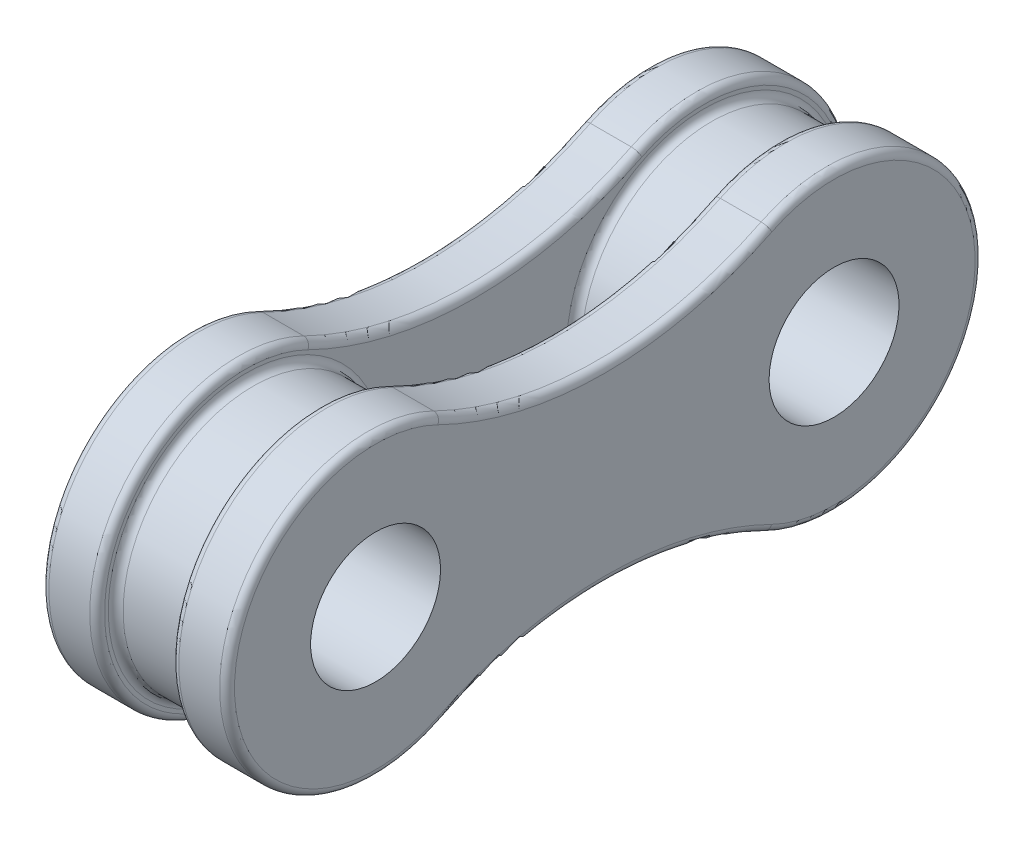
ISO-10303-21;
HEADER;
FILE_DESCRIPTION(('STEP AP214'),'2;1');
FILE_NAME('part.step','',(''),(''),'','','');
FILE_SCHEMA(('AUTOMOTIVE_DESIGN { 1 0 10303 214 1 1 1 1 }'));
ENDSEC;
DATA;
#1=APPLICATION_CONTEXT('core data for automotive mechanical design processes');
#2=APPLICATION_PROTOCOL_DEFINITION('international standard','automotive_design',2000,#1);
#3=PRODUCT_CONTEXT('',#1,'mechanical');
#4=PRODUCT('Part','Part','',(#3));
#5=PRODUCT_RELATED_PRODUCT_CATEGORY('part','',(#4));
#6=PRODUCT_DEFINITION_FORMATION('','',#4);
#7=PRODUCT_DEFINITION_CONTEXT('part definition',#1,'design');
#8=PRODUCT_DEFINITION('design','',#6,#7);
#9=PRODUCT_DEFINITION_SHAPE('','',#8);
#10=(LENGTH_UNIT() NAMED_UNIT(*) SI_UNIT(.MILLI.,.METRE.));
#11=(NAMED_UNIT(*) PLANE_ANGLE_UNIT() SI_UNIT($,.RADIAN.));
#12=(NAMED_UNIT(*) SI_UNIT($,.STERADIAN.) SOLID_ANGLE_UNIT());
#13=UNCERTAINTY_MEASURE_WITH_UNIT(LENGTH_MEASURE(1.E-05),#10,'distance_accuracy_value','');
#14=(GEOMETRIC_REPRESENTATION_CONTEXT(3) GLOBAL_UNCERTAINTY_ASSIGNED_CONTEXT((#13)) GLOBAL_UNIT_ASSIGNED_CONTEXT((#10,
#11,#12)) REPRESENTATION_CONTEXT('',''));
#15=CARTESIAN_POINT('',(0.,0.,0.));
#16=DIRECTION('',(0.,0.,1.));
#17=DIRECTION('',(1.,0.,0.));
#18=AXIS2_PLACEMENT_3D('',#15,#16,#17);
#19=CARTESIAN_POINT('',(2.5,6.2823040160438,-3.0875));
#20=DIRECTION('',(1.,0.,0.));
#21=DIRECTION('',(0.,0.,-1.));
#22=AXIS2_PLACEMENT_3D('',#19,#20,#21);
#23=PLANE('',#22);
#24=CARTESIAN_POINT('',(2.5,-12.5646080320876,0.));
#25=DIRECTION('',(1.,0.,0.));
#26=DIRECTION('',(0.,0.,-1.));
#27=AXIS2_PLACEMENT_3D('',#24,#25,#26);
#28=CIRCLE('',#27,10.2);
#29=CARTESIAN_POINT('',(2.5,-3.41039360870949,4.49892857142857));
#30=VERTEX_POINT('',#29);
#31=CARTESIAN_POINT('',(2.5,-3.41039360870949,-4.49892857142857));
#32=VERTEX_POINT('',#31);
#33=EDGE_CURVE('E188',#30,#32,#28,.F.);
#34=ORIENTED_EDGE('',*,*,#33,.T.);
#35=CARTESIAN_POINT('',(2.5,0.,-6.175));
#36=DIRECTION('',(1.,0.,0.));
#37=DIRECTION('',(0.,0.,-1.));
#38=AXIS2_PLACEMENT_3D('',#35,#36,#37);
#39=CIRCLE('',#38,3.8);
#40=CARTESIAN_POINT('',(2.5,3.41039360870949,-4.49892857142857));
#41=VERTEX_POINT('',#40);
#42=EDGE_CURVE('E168',#32,#41,#39,.T.);
#43=ORIENTED_EDGE('',*,*,#42,.T.);
#44=CARTESIAN_POINT('',(2.5,12.5646080320876,0.));
#45=DIRECTION('',(1.,0.,0.));
#46=DIRECTION('',(0.,0.,-1.));
#47=AXIS2_PLACEMENT_3D('',#44,#45,#46);
#48=CIRCLE('',#47,10.2);
#49=CARTESIAN_POINT('',(2.5,3.41039360870949,4.49892857142857));
#50=VERTEX_POINT('',#49);
#51=EDGE_CURVE('E177',#41,#50,#48,.F.);
#52=ORIENTED_EDGE('',*,*,#51,.T.);
#53=CARTESIAN_POINT('',(2.5,0.,6.175));
#54=DIRECTION('',(1.,0.,0.));
#55=DIRECTION('',(0.,0.,-1.));
#56=AXIS2_PLACEMENT_3D('',#53,#54,#55);
#57=CIRCLE('',#56,3.8);
#58=EDGE_CURVE('E183',#50,#30,#57,.T.);
#59=ORIENTED_EDGE('',*,*,#58,.T.);
#60=EDGE_LOOP('',(#34,#43,#52,#59));
#61=FACE_BOUND('',#60,.T.);
#62=CARTESIAN_POINT('',(2.5,0.,6.175));
#63=DIRECTION('',(1.,0.,0.));
#64=DIRECTION('',(0.,0.,-1.));
#65=AXIS2_PLACEMENT_3D('',#62,#63,#64);
#66=CIRCLE('',#65,1.75);
#67=CARTESIAN_POINT('',(2.5,0.,4.425));
#68=VERTEX_POINT('',#67);
#69=EDGE_CURVE('E746',#68,#68,#66,.T.);
#70=ORIENTED_EDGE('',*,*,#69,.F.);
#71=EDGE_LOOP('',(#70));
#72=FACE_BOUND('',#71,.T.);
#73=CARTESIAN_POINT('',(2.5,0.,-6.175));
#74=DIRECTION('',(1.,0.,0.));
#75=DIRECTION('',(0.,0.,1.));
#76=AXIS2_PLACEMENT_3D('',#73,#74,#75);
#77=CIRCLE('',#76,1.75);
#78=CARTESIAN_POINT('',(2.5,0.,-4.425));
#79=VERTEX_POINT('',#78);
#80=EDGE_CURVE('E743',#79,#79,#77,.T.);
#81=ORIENTED_EDGE('',*,*,#80,.F.);
#82=EDGE_LOOP('',(#81));
#83=FACE_BOUND('',#82,.T.);
#84=ADVANCED_FACE('F48',(#61,#72,#83),#23,.T.);
#85=CARTESIAN_POINT('',(1.,6.2823040160438,-3.0875));
#86=DIRECTION('',(1.,0.,0.));
#87=DIRECTION('',(0.,0.,-1.));
#88=AXIS2_PLACEMENT_3D('',#85,#86,#87);
#89=PLANE('',#88);
#90=CARTESIAN_POINT('',(1.,-12.5646080320876,0.));
#91=DIRECTION('',(1.,0.,0.));
#92=DIRECTION('',(0.,0.,-1.));
#93=AXIS2_PLACEMENT_3D('',#90,#91,#92);
#94=CIRCLE('',#93,10.2);
#95=CARTESIAN_POINT('',(1.,-3.41039360870949,-4.49892857142857));
#96=VERTEX_POINT('',#95);
#97=CARTESIAN_POINT('',(1.,-3.41039360870949,4.49892857142857));
#98=VERTEX_POINT('',#97);
#99=EDGE_CURVE('E216',#96,#98,#94,.T.);
#100=ORIENTED_EDGE('',*,*,#99,.T.);
#101=CARTESIAN_POINT('',(1.,0.,6.175));
#102=DIRECTION('',(1.,0.,0.));
#103=DIRECTION('',(0.,0.,-1.));
#104=AXIS2_PLACEMENT_3D('',#101,#102,#103);
#105=CIRCLE('',#104,3.8);
#106=CARTESIAN_POINT('',(1.,3.41039360870949,4.49892857142857));
#107=VERTEX_POINT('',#106);
#108=EDGE_CURVE('E218',#98,#107,#105,.F.);
#109=ORIENTED_EDGE('',*,*,#108,.T.);
#110=CARTESIAN_POINT('',(1.,12.5646080320876,0.));
#111=DIRECTION('',(1.,0.,0.));
#112=DIRECTION('',(0.,0.,-1.));
#113=AXIS2_PLACEMENT_3D('',#110,#111,#112);
#114=CIRCLE('',#113,10.2);
#115=CARTESIAN_POINT('',(1.,3.41039360870949,-4.49892857142857));
#116=VERTEX_POINT('',#115);
#117=EDGE_CURVE('E212',#107,#116,#114,.T.);
#118=ORIENTED_EDGE('',*,*,#117,.T.);
#119=CARTESIAN_POINT('',(1.,0.,-6.175));
#120=DIRECTION('',(1.,0.,0.));
#121=DIRECTION('',(0.,0.,-1.));
#122=AXIS2_PLACEMENT_3D('',#119,#120,#121);
#123=CIRCLE('',#122,3.8);
#124=EDGE_CURVE('E214',#116,#96,#123,.F.);
#125=ORIENTED_EDGE('',*,*,#124,.T.);
#126=EDGE_LOOP('',(#100,#109,#118,#125));
#127=FACE_BOUND('',#126,.T.);
#128=CARTESIAN_POINT('',(1.,0.,-6.175));
#129=DIRECTION('',(1.,0.,0.));
#130=DIRECTION('',(0.,0.,-1.));
#131=AXIS2_PLACEMENT_3D('',#128,#129,#130);
#132=CIRCLE('',#131,3.7);
#133=CARTESIAN_POINT('',(1.,0.,-9.875));
#134=VERTEX_POINT('',#133);
#135=EDGE_CURVE('E209',#134,#134,#132,.T.);
#136=ORIENTED_EDGE('',*,*,#135,.T.);
#137=EDGE_LOOP('',(#136));
#138=FACE_BOUND('',#137,.T.);
#139=CARTESIAN_POINT('',(1.,0.,6.175));
#140=DIRECTION('',(1.,0.,0.));
#141=DIRECTION('',(0.,0.,-1.));
#142=AXIS2_PLACEMENT_3D('',#139,#140,#141);
#143=CIRCLE('',#142,3.7);
#144=CARTESIAN_POINT('',(1.,0.,2.475));
#145=VERTEX_POINT('',#144);
#146=EDGE_CURVE('E206',#145,#145,#143,.T.);
#147=ORIENTED_EDGE('',*,*,#146,.T.);
#148=EDGE_LOOP('',(#147));
#149=FACE_BOUND('',#148,.T.);
#150=ADVANCED_FACE('F350',(#127,#138,#149),#89,.F.);
#151=CARTESIAN_POINT('',(2.5,12.5646080320876,0.));
#152=DIRECTION('',(-1.,0.,0.));
#153=DIRECTION('',(0.,0.,1.));
#154=AXIS2_PLACEMENT_3D('',#151,#152,#153);
#155=CYLINDRICAL_SURFACE('',#154,10.);
#156=DIRECTION('',(-1.,0.,0.));
#157=VECTOR('',#156,1.);
#158=CARTESIAN_POINT('',(2.5,3.58988800916788,-4.41071428571429));
#159=LINE('',#158,#157);
#160=CARTESIAN_POINT('',(2.3,3.58988800916788,-4.41071428571429));
#161=VERTEX_POINT('',#160);
#162=CARTESIAN_POINT('',(1.2,3.58988800916788,-4.41071428571429));
#163=VERTEX_POINT('',#162);
#164=EDGE_CURVE('E750',#161,#163,#159,.T.);
#165=ORIENTED_EDGE('',*,*,#164,.T.);
#166=CARTESIAN_POINT('',(1.2,12.5646080320876,0.));
#167=DIRECTION('',(1.,0.,0.));
#168=DIRECTION('',(0.,0.,-1.));
#169=AXIS2_PLACEMENT_3D('',#166,#167,#168);
#170=CIRCLE('',#169,10.);
#171=CARTESIAN_POINT('',(1.2,3.58988800916788,4.41071428571429));
#172=VERTEX_POINT('',#171);
#173=EDGE_CURVE('E223',#163,#172,#170,.F.);
#174=ORIENTED_EDGE('',*,*,#173,.T.);
#175=DIRECTION('',(-1.,0.,0.));
#176=VECTOR('',#175,1.);
#177=CARTESIAN_POINT('',(2.5,3.58988800916788,4.41071428571429));
#178=LINE('',#177,#176);
#179=CARTESIAN_POINT('',(2.3,3.58988800916788,4.41071428571429));
#180=VERTEX_POINT('',#179);
#181=EDGE_CURVE('E184',#180,#172,#178,.T.);
#182=ORIENTED_EDGE('',*,*,#181,.F.);
#183=CARTESIAN_POINT('',(2.3,12.5646080320876,0.));
#184=DIRECTION('',(1.,0.,0.));
#185=DIRECTION('',(0.,0.,-1.));
#186=AXIS2_PLACEMENT_3D('',#183,#184,#185);
#187=CIRCLE('',#186,10.);
#188=EDGE_CURVE('E221',#180,#161,#187,.T.);
#189=ORIENTED_EDGE('',*,*,#188,.T.);
#190=EDGE_LOOP('',(#165,#174,#182,#189));
#191=FACE_BOUND('',#190,.T.);
#192=ADVANCED_FACE('F355',(#191),#155,.F.);
#193=CARTESIAN_POINT('',(2.5,0.,6.175));
#194=DIRECTION('',(-1.,0.,0.));
#195=DIRECTION('',(0.,0.,1.));
#196=AXIS2_PLACEMENT_3D('',#193,#194,#195);
#197=CYLINDRICAL_SURFACE('',#196,4.);
#198=DIRECTION('',(-1.,0.,0.));
#199=VECTOR('',#198,1.);
#200=CARTESIAN_POINT('',(2.5,-3.58988800916788,4.41071428571429));
#201=LINE('',#200,#199);
#202=CARTESIAN_POINT('',(2.3,-3.58988800916788,4.41071428571429));
#203=VERTEX_POINT('',#202);
#204=CARTESIAN_POINT('',(1.2,-3.58988800916788,4.41071428571429));
#205=VERTEX_POINT('',#204);
#206=EDGE_CURVE('E756',#203,#205,#201,.T.);
#207=ORIENTED_EDGE('',*,*,#206,.F.);
#208=CARTESIAN_POINT('',(2.3,0.,6.175));
#209=DIRECTION('',(1.,0.,0.));
#210=DIRECTION('',(0.,0.,-1.));
#211=AXIS2_PLACEMENT_3D('',#208,#209,#210);
#212=CIRCLE('',#211,4.);
#213=EDGE_CURVE('E204',#203,#180,#212,.F.);
#214=ORIENTED_EDGE('',*,*,#213,.T.);
#215=ORIENTED_EDGE('',*,*,#181,.T.);
#216=CARTESIAN_POINT('',(1.2,0.,6.175));
#217=DIRECTION('',(1.,0.,0.));
#218=DIRECTION('',(0.,0.,-1.));
#219=AXIS2_PLACEMENT_3D('',#216,#217,#218);
#220=CIRCLE('',#219,4.);
#221=EDGE_CURVE('E201',#172,#205,#220,.T.);
#222=ORIENTED_EDGE('',*,*,#221,.T.);
#223=EDGE_LOOP('',(#207,#214,#215,#222));
#224=FACE_BOUND('',#223,.T.);
#225=ADVANCED_FACE('F369',(#224),#197,.T.);
#226=CARTESIAN_POINT('',(2.5,-12.5646080320876,0.));
#227=DIRECTION('',(-1.,0.,0.));
#228=DIRECTION('',(0.,0.,1.));
#229=AXIS2_PLACEMENT_3D('',#226,#227,#228);
#230=CYLINDRICAL_SURFACE('',#229,10.);
#231=DIRECTION('',(-1.,0.,0.));
#232=VECTOR('',#231,1.);
#233=CARTESIAN_POINT('',(2.5,-3.58988800916788,-4.41071428571429));
#234=LINE('',#233,#232);
#235=CARTESIAN_POINT('',(2.3,-3.58988800916788,-4.41071428571429));
#236=VERTEX_POINT('',#235);
#237=CARTESIAN_POINT('',(1.2,-3.58988800916788,-4.41071428571429));
#238=VERTEX_POINT('',#237);
#239=EDGE_CURVE('E753',#236,#238,#234,.T.);
#240=ORIENTED_EDGE('',*,*,#239,.F.);
#241=CARTESIAN_POINT('',(2.3,-12.5646080320876,0.));
#242=DIRECTION('',(1.,0.,0.));
#243=DIRECTION('',(0.,0.,-1.));
#244=AXIS2_PLACEMENT_3D('',#241,#242,#243);
#245=CIRCLE('',#244,10.);
#246=EDGE_CURVE('E199',#236,#203,#245,.T.);
#247=ORIENTED_EDGE('',*,*,#246,.T.);
#248=ORIENTED_EDGE('',*,*,#206,.T.);
#249=CARTESIAN_POINT('',(1.2,-12.5646080320876,0.));
#250=DIRECTION('',(1.,0.,0.));
#251=DIRECTION('',(0.,0.,-1.));
#252=AXIS2_PLACEMENT_3D('',#249,#250,#251);
#253=CIRCLE('',#252,10.);
#254=EDGE_CURVE('E197',#205,#238,#253,.F.);
#255=ORIENTED_EDGE('',*,*,#254,.T.);
#256=EDGE_LOOP('',(#240,#247,#248,#255));
#257=FACE_BOUND('',#256,.T.);
#258=ADVANCED_FACE('F365',(#257),#230,.F.);
#259=CARTESIAN_POINT('',(2.5,0.,-6.175));
#260=DIRECTION('',(-1.,0.,0.));
#261=DIRECTION('',(0.,0.,1.));
#262=AXIS2_PLACEMENT_3D('',#259,#260,#261);
#263=CYLINDRICAL_SURFACE('',#262,4.);
#264=ORIENTED_EDGE('',*,*,#164,.F.);
#265=CARTESIAN_POINT('',(2.3,0.,-6.175));
#266=DIRECTION('',(1.,0.,0.));
#267=DIRECTION('',(0.,0.,-1.));
#268=AXIS2_PLACEMENT_3D('',#265,#266,#267);
#269=CIRCLE('',#268,4.);
#270=EDGE_CURVE('E170',#161,#236,#269,.F.);
#271=ORIENTED_EDGE('',*,*,#270,.T.);
#272=ORIENTED_EDGE('',*,*,#239,.T.);
#273=CARTESIAN_POINT('',(1.2,0.,-6.175));
#274=DIRECTION('',(1.,0.,0.));
#275=DIRECTION('',(0.,0.,-1.));
#276=AXIS2_PLACEMENT_3D('',#273,#274,#275);
#277=CIRCLE('',#276,4.);
#278=EDGE_CURVE('E190',#238,#163,#277,.T.);
#279=ORIENTED_EDGE('',*,*,#278,.T.);
#280=EDGE_LOOP('',(#264,#271,#272,#279));
#281=FACE_BOUND('',#280,.T.);
#282=ADVANCED_FACE('F362',(#281),#263,.T.);
#283=CARTESIAN_POINT('',(2.5,0.,6.175));
#284=DIRECTION('',(-1.,0.,0.));
#285=DIRECTION('',(0.,0.,1.));
#286=AXIS2_PLACEMENT_3D('',#283,#284,#285);
#287=CYLINDRICAL_SURFACE('',#286,1.75);
#288=CARTESIAN_POINT('',(-2.3,0.,6.175));
#289=DIRECTION('',(1.,0.,0.));
#290=DIRECTION('',(0.,0.,-1.));
#291=AXIS2_PLACEMENT_3D('',#288,#289,#290);
#292=CIRCLE('',#291,1.75);
#293=CARTESIAN_POINT('',(-2.3,0.,4.425));
#294=VERTEX_POINT('',#293);
#295=EDGE_CURVE('E12',#294,#294,#292,.F.);
#296=ORIENTED_EDGE('',*,*,#295,.T.);
#297=EDGE_LOOP('',(#296));
#298=FACE_BOUND('',#297,.T.);
#299=ORIENTED_EDGE('',*,*,#69,.T.);
#300=EDGE_LOOP('',(#299));
#301=FACE_BOUND('',#300,.T.);
#302=ADVANCED_FACE('F359',(#298,#301),#287,.F.);
#303=CARTESIAN_POINT('',(2.5,0.,-6.175));
#304=DIRECTION('',(-1.,0.,0.));
#305=DIRECTION('',(0.,0.,1.));
#306=AXIS2_PLACEMENT_3D('',#303,#304,#305);
#307=CYLINDRICAL_SURFACE('',#306,1.75);
#308=CARTESIAN_POINT('',(-2.3,0.,-6.175));
#309=DIRECTION('',(1.,0.,0.));
#310=DIRECTION('',(0.,0.,-1.));
#311=AXIS2_PLACEMENT_3D('',#308,#309,#310);
#312=CIRCLE('',#311,1.75);
#313=CARTESIAN_POINT('',(-2.3,0.,-7.925));
#314=VERTEX_POINT('',#313);
#315=EDGE_CURVE('E57',#314,#314,#312,.F.);
#316=ORIENTED_EDGE('',*,*,#315,.T.);
#317=EDGE_LOOP('',(#316));
#318=FACE_BOUND('',#317,.T.);
#319=ORIENTED_EDGE('',*,*,#80,.T.);
#320=EDGE_LOOP('',(#319));
#321=FACE_BOUND('',#320,.T.);
#322=ADVANCED_FACE('F577',(#318,#321),#307,.F.);
#323=CARTESIAN_POINT('',(-2.502,0.,-6.175));
#324=DIRECTION('',(1.,0.,0.));
#325=DIRECTION('',(0.,0.,-1.));
#326=AXIS2_PLACEMENT_3D('',#323,#324,#325);
#327=CYLINDRICAL_SURFACE('',#326,3.5);
#328=CARTESIAN_POINT('',(0.8,0.,-6.175));
#329=DIRECTION('',(1.,0.,0.));
#330=DIRECTION('',(0.,0.,-1.));
#331=AXIS2_PLACEMENT_3D('',#328,#329,#330);
#332=CIRCLE('',#331,3.5);
#333=CARTESIAN_POINT('',(0.8,0.,-9.675));
#334=VERTEX_POINT('',#333);
#335=EDGE_CURVE('E228',#334,#334,#332,.F.);
#336=ORIENTED_EDGE('',*,*,#335,.T.);
#337=EDGE_LOOP('',(#336));
#338=FACE_BOUND('',#337,.T.);
#339=CARTESIAN_POINT('',(-0.8,0.,-6.175));
#340=DIRECTION('',(1.,0.,0.));
#341=DIRECTION('',(0.,0.,-1.));
#342=AXIS2_PLACEMENT_3D('',#339,#340,#341);
#343=CIRCLE('',#342,3.5);
#344=CARTESIAN_POINT('',(-0.8,0.,-9.675));
#345=VERTEX_POINT('',#344);
#346=EDGE_CURVE('E225',#345,#345,#343,.T.);
#347=ORIENTED_EDGE('',*,*,#346,.T.);
#348=EDGE_LOOP('',(#347));
#349=FACE_BOUND('',#348,.T.);
#350=ADVANCED_FACE('F570',(#338,#349),#327,.T.);
#351=CARTESIAN_POINT('',(-2.5,0.,6.175));
#352=DIRECTION('',(1.,0.,0.));
#353=DIRECTION('',(0.,0.,-1.));
#354=AXIS2_PLACEMENT_3D('',#351,#352,#353);
#355=CYLINDRICAL_SURFACE('',#354,4.);
#356=DIRECTION('',(1.,0.,0.));
#357=VECTOR('',#356,1.);
#358=CARTESIAN_POINT('',(-2.5,-3.58988800916789,4.41071428571429));
#359=LINE('',#358,#357);
#360=CARTESIAN_POINT('',(-2.3,-3.58988800916789,4.41071428571429));
#361=VERTEX_POINT('',#360);
#362=CARTESIAN_POINT('',(-1.2,-3.58988800916789,4.41071428571429));
#363=VERTEX_POINT('',#362);
#364=EDGE_CURVE('E289',#361,#363,#359,.T.);
#365=ORIENTED_EDGE('',*,*,#364,.T.);
#366=CARTESIAN_POINT('',(-1.2,0.,6.175));
#367=DIRECTION('',(1.,0.,0.));
#368=DIRECTION('',(0.,0.,-1.));
#369=AXIS2_PLACEMENT_3D('',#366,#367,#368);
#370=CIRCLE('',#369,4.);
#371=CARTESIAN_POINT('',(-1.2,3.58988800916788,4.41071428571429));
#372=VERTEX_POINT('',#371);
#373=EDGE_CURVE('E268',#363,#372,#370,.F.);
#374=ORIENTED_EDGE('',*,*,#373,.T.);
#375=DIRECTION('',(1.,0.,0.));
#376=VECTOR('',#375,1.);
#377=CARTESIAN_POINT('',(-2.5,3.58988800916788,4.41071428571429));
#378=LINE('',#377,#376);
#379=CARTESIAN_POINT('',(-2.3,3.58988800916788,4.41071428571429));
#380=VERTEX_POINT('',#379);
#381=EDGE_CURVE('E747',#380,#372,#378,.T.);
#382=ORIENTED_EDGE('',*,*,#381,.F.);
#383=CARTESIAN_POINT('',(-2.3,0.,6.175));
#384=DIRECTION('',(1.,0.,0.));
#385=DIRECTION('',(0.,0.,-1.));
#386=AXIS2_PLACEMENT_3D('',#383,#384,#385);
#387=CIRCLE('',#386,4.);
#388=EDGE_CURVE('E266',#380,#361,#387,.T.);
#389=ORIENTED_EDGE('',*,*,#388,.T.);
#390=EDGE_LOOP('',(#365,#374,#382,#389));
#391=FACE_BOUND('',#390,.T.);
#392=ADVANCED_FACE('F576',(#391),#355,.T.);
#393=CARTESIAN_POINT('',(-2.5,12.5646080320876,0.));
#394=DIRECTION('',(1.,0.,0.));
#395=DIRECTION('',(0.,0.,-1.));
#396=AXIS2_PLACEMENT_3D('',#393,#394,#395);
#397=CYLINDRICAL_SURFACE('',#396,10.);
#398=ORIENTED_EDGE('',*,*,#381,.T.);
#399=CARTESIAN_POINT('',(-1.2,12.5646080320876,0.));
#400=DIRECTION('',(1.,0.,0.));
#401=DIRECTION('',(0.,0.,-1.));
#402=AXIS2_PLACEMENT_3D('',#399,#400,#401);
#403=CIRCLE('',#402,10.);
#404=CARTESIAN_POINT('',(-1.2,3.58988800916788,-4.41071428571429));
#405=VERTEX_POINT('',#404);
#406=EDGE_CURVE('E254',#372,#405,#403,.T.);
#407=ORIENTED_EDGE('',*,*,#406,.T.);
#408=DIRECTION('',(1.,0.,0.));
#409=VECTOR('',#408,1.);
#410=CARTESIAN_POINT('',(-2.5,3.58988800916788,-4.41071428571429));
#411=LINE('',#410,#409);
#412=CARTESIAN_POINT('',(-2.3,3.58988800916788,-4.41071428571429));
#413=VERTEX_POINT('',#412);
#414=EDGE_CURVE('E739',#413,#405,#411,.T.);
#415=ORIENTED_EDGE('',*,*,#414,.F.);
#416=CARTESIAN_POINT('',(-2.3,12.5646080320876,0.));
#417=DIRECTION('',(1.,0.,0.));
#418=DIRECTION('',(0.,0.,-1.));
#419=AXIS2_PLACEMENT_3D('',#416,#417,#418);
#420=CIRCLE('',#419,10.);
#421=EDGE_CURVE('E252',#413,#380,#420,.F.);
#422=ORIENTED_EDGE('',*,*,#421,.T.);
#423=EDGE_LOOP('',(#398,#407,#415,#422));
#424=FACE_BOUND('',#423,.T.);
#425=ADVANCED_FACE('F648',(#424),#397,.F.);
#426=CARTESIAN_POINT('',(-2.5,0.,-6.175));
#427=DIRECTION('',(1.,0.,0.));
#428=DIRECTION('',(0.,0.,-1.));
#429=AXIS2_PLACEMENT_3D('',#426,#427,#428);
#430=CYLINDRICAL_SURFACE('',#429,4.);
#431=ORIENTED_EDGE('',*,*,#414,.T.);
#432=CARTESIAN_POINT('',(-1.2,0.,-6.175));
#433=DIRECTION('',(1.,0.,0.));
#434=DIRECTION('',(0.,0.,-1.));
#435=AXIS2_PLACEMENT_3D('',#432,#433,#434);
#436=CIRCLE('',#435,4.);
#437=CARTESIAN_POINT('',(-1.2,-3.58988800916788,-4.41071428571429));
#438=VERTEX_POINT('',#437);
#439=EDGE_CURVE('E259',#405,#438,#436,.F.);
#440=ORIENTED_EDGE('',*,*,#439,.T.);
#441=DIRECTION('',(1.,0.,0.));
#442=VECTOR('',#441,1.);
#443=CARTESIAN_POINT('',(-2.5,-3.58988800916788,-4.41071428571429));
#444=LINE('',#443,#442);
#445=CARTESIAN_POINT('',(-2.3,-3.58988800916788,-4.41071428571429));
#446=VERTEX_POINT('',#445);
#447=EDGE_CURVE('E735',#446,#438,#444,.T.);
#448=ORIENTED_EDGE('',*,*,#447,.F.);
#449=CARTESIAN_POINT('',(-2.3,0.,-6.175));
#450=DIRECTION('',(1.,0.,0.));
#451=DIRECTION('',(0.,0.,-1.));
#452=AXIS2_PLACEMENT_3D('',#449,#450,#451);
#453=CIRCLE('',#452,4.);
#454=EDGE_CURVE('E257',#446,#413,#453,.T.);
#455=ORIENTED_EDGE('',*,*,#454,.T.);
#456=EDGE_LOOP('',(#431,#440,#448,#455));
#457=FACE_BOUND('',#456,.T.);
#458=ADVANCED_FACE('F657',(#457),#430,.T.);
#459=CARTESIAN_POINT('',(-2.5,-12.5646080320876,0.));
#460=DIRECTION('',(1.,0.,0.));
#461=DIRECTION('',(0.,0.,-1.));
#462=AXIS2_PLACEMENT_3D('',#459,#460,#461);
#463=CYLINDRICAL_SURFACE('',#462,10.);
#464=ORIENTED_EDGE('',*,*,#447,.T.);
#465=CARTESIAN_POINT('',(-1.2,-12.5646080320876,0.));
#466=DIRECTION('',(1.,0.,0.));
#467=DIRECTION('',(0.,0.,-1.));
#468=AXIS2_PLACEMENT_3D('',#465,#466,#467);
#469=CIRCLE('',#468,10.);
#470=EDGE_CURVE('E264',#438,#363,#469,.T.);
#471=ORIENTED_EDGE('',*,*,#470,.T.);
#472=ORIENTED_EDGE('',*,*,#364,.F.);
#473=CARTESIAN_POINT('',(-2.3,-12.5646080320876,0.));
#474=DIRECTION('',(1.,0.,0.));
#475=DIRECTION('',(0.,0.,-1.));
#476=AXIS2_PLACEMENT_3D('',#473,#474,#475);
#477=CIRCLE('',#476,10.);
#478=EDGE_CURVE('E261',#361,#446,#477,.F.);
#479=ORIENTED_EDGE('',*,*,#478,.T.);
#480=EDGE_LOOP('',(#464,#471,#472,#479));
#481=FACE_BOUND('',#480,.T.);
#482=ADVANCED_FACE('F335',(#481),#463,.F.);
#483=CARTESIAN_POINT('',(-2.5,-6.2823040160438,3.0875));
#484=DIRECTION('',(1.,0.,0.));
#485=DIRECTION('',(0.,0.,-1.));
#486=AXIS2_PLACEMENT_3D('',#483,#484,#485);
#487=PLANE('',#486);
#488=CARTESIAN_POINT('',(-2.5,0.,-6.175));
#489=DIRECTION('',(1.,0.,0.));
#490=DIRECTION('',(0.,0.,-1.));
#491=AXIS2_PLACEMENT_3D('',#488,#489,#490);
#492=CIRCLE('',#491,3.8);
#493=CARTESIAN_POINT('',(-2.5,3.41039360870949,-4.49892857142857));
#494=VERTEX_POINT('',#493);
#495=CARTESIAN_POINT('',(-2.5,-3.41039360870949,-4.49892857142857));
#496=VERTEX_POINT('',#495);
#497=EDGE_CURVE('E65',#494,#496,#492,.F.);
#498=ORIENTED_EDGE('',*,*,#497,.T.);
#499=CARTESIAN_POINT('',(-2.5,-12.5646080320876,0.));
#500=DIRECTION('',(1.,0.,0.));
#501=DIRECTION('',(0.,0.,-1.));
#502=AXIS2_PLACEMENT_3D('',#499,#500,#501);
#503=CIRCLE('',#502,10.2);
#504=CARTESIAN_POINT('',(-2.5,-3.41039360870949,4.49892857142858));
#505=VERTEX_POINT('',#504);
#506=EDGE_CURVE('E280',#496,#505,#503,.T.);
#507=ORIENTED_EDGE('',*,*,#506,.T.);
#508=CARTESIAN_POINT('',(-2.5,0.,6.175));
#509=DIRECTION('',(1.,0.,0.));
#510=DIRECTION('',(0.,0.,-1.));
#511=AXIS2_PLACEMENT_3D('',#508,#509,#510);
#512=CIRCLE('',#511,3.8);
#513=CARTESIAN_POINT('',(-2.5,3.41039360870949,4.49892857142857));
#514=VERTEX_POINT('',#513);
#515=EDGE_CURVE('E276',#505,#514,#512,.F.);
#516=ORIENTED_EDGE('',*,*,#515,.T.);
#517=CARTESIAN_POINT('',(-2.5,12.5646080320876,0.));
#518=DIRECTION('',(1.,0.,0.));
#519=DIRECTION('',(0.,0.,-1.));
#520=AXIS2_PLACEMENT_3D('',#517,#518,#519);
#521=CIRCLE('',#520,10.2);
#522=EDGE_CURVE('E70',#514,#494,#521,.T.);
#523=ORIENTED_EDGE('',*,*,#522,.T.);
#524=EDGE_LOOP('',(#498,#507,#516,#523));
#525=FACE_BOUND('',#524,.T.);
#526=CARTESIAN_POINT('',(-2.5,0.,-6.175));
#527=DIRECTION('',(1.,0.,0.));
#528=DIRECTION('',(0.,0.,-1.));
#529=AXIS2_PLACEMENT_3D('',#526,#527,#528);
#530=CIRCLE('',#529,1.95);
#531=CARTESIAN_POINT('',(-2.5,0.,-8.125));
#532=VERTEX_POINT('',#531);
#533=EDGE_CURVE('E273',#532,#532,#530,.T.);
#534=ORIENTED_EDGE('',*,*,#533,.T.);
#535=EDGE_LOOP('',(#534));
#536=FACE_BOUND('',#535,.T.);
#537=CARTESIAN_POINT('',(-2.5,0.,6.175));
#538=DIRECTION('',(1.,0.,0.));
#539=DIRECTION('',(0.,0.,-1.));
#540=AXIS2_PLACEMENT_3D('',#537,#538,#539);
#541=CIRCLE('',#540,1.95);
#542=CARTESIAN_POINT('',(-2.5,0.,4.225));
#543=VERTEX_POINT('',#542);
#544=EDGE_CURVE('E270',#543,#543,#541,.T.);
#545=ORIENTED_EDGE('',*,*,#544,.T.);
#546=EDGE_LOOP('',(#545));
#547=FACE_BOUND('',#546,.T.);
#548=ADVANCED_FACE('F331',(#525,#536,#547),#487,.F.);
#549=CARTESIAN_POINT('',(-1.,-6.2823040160438,3.0875));
#550=DIRECTION('',(1.,0.,0.));
#551=DIRECTION('',(0.,0.,-1.));
#552=AXIS2_PLACEMENT_3D('',#549,#550,#551);
#553=PLANE('',#552);
#554=CARTESIAN_POINT('',(-1.,0.,-6.175));
#555=DIRECTION('',(1.,0.,0.));
#556=DIRECTION('',(0.,0.,-1.));
#557=AXIS2_PLACEMENT_3D('',#554,#555,#556);
#558=CIRCLE('',#557,3.8);
#559=CARTESIAN_POINT('',(-1.,-3.41039360870949,-4.49892857142857));
#560=VERTEX_POINT('',#559);
#561=CARTESIAN_POINT('',(-1.,3.41039360870949,-4.49892857142857));
#562=VERTEX_POINT('',#561);
#563=EDGE_CURVE('E247',#560,#562,#558,.T.);
#564=ORIENTED_EDGE('',*,*,#563,.T.);
#565=CARTESIAN_POINT('',(-1.,12.5646080320876,0.));
#566=DIRECTION('',(1.,0.,0.));
#567=DIRECTION('',(0.,0.,-1.));
#568=AXIS2_PLACEMENT_3D('',#565,#566,#567);
#569=CIRCLE('',#568,10.2);
#570=CARTESIAN_POINT('',(-1.,3.41039360870949,4.49892857142857));
#571=VERTEX_POINT('',#570);
#572=EDGE_CURVE('E249',#562,#571,#569,.F.);
#573=ORIENTED_EDGE('',*,*,#572,.T.);
#574=CARTESIAN_POINT('',(-1.,0.,6.175));
#575=DIRECTION('',(1.,0.,0.));
#576=DIRECTION('',(0.,0.,-1.));
#577=AXIS2_PLACEMENT_3D('',#574,#575,#576);
#578=CIRCLE('',#577,3.8);
#579=CARTESIAN_POINT('',(-1.,-3.41039360870949,4.49892857142858));
#580=VERTEX_POINT('',#579);
#581=EDGE_CURVE('E243',#571,#580,#578,.T.);
#582=ORIENTED_EDGE('',*,*,#581,.T.);
#583=CARTESIAN_POINT('',(-1.,-12.5646080320876,0.));
#584=DIRECTION('',(1.,0.,0.));
#585=DIRECTION('',(0.,0.,-1.));
#586=AXIS2_PLACEMENT_3D('',#583,#584,#585);
#587=CIRCLE('',#586,10.2);
#588=EDGE_CURVE('E245',#580,#560,#587,.F.);
#589=ORIENTED_EDGE('',*,*,#588,.T.);
#590=EDGE_LOOP('',(#564,#573,#582,#589));
#591=FACE_BOUND('',#590,.T.);
#592=CARTESIAN_POINT('',(-1.,0.,-6.175));
#593=DIRECTION('',(1.,0.,0.));
#594=DIRECTION('',(0.,0.,-1.));
#595=AXIS2_PLACEMENT_3D('',#592,#593,#594);
#596=CIRCLE('',#595,3.7);
#597=CARTESIAN_POINT('',(-1.,0.,-9.875));
#598=VERTEX_POINT('',#597);
#599=EDGE_CURVE('E240',#598,#598,#596,.F.);
#600=ORIENTED_EDGE('',*,*,#599,.T.);
#601=EDGE_LOOP('',(#600));
#602=FACE_BOUND('',#601,.T.);
#603=CARTESIAN_POINT('',(-1.,0.,6.175));
#604=DIRECTION('',(1.,0.,0.));
#605=DIRECTION('',(0.,0.,-1.));
#606=AXIS2_PLACEMENT_3D('',#603,#604,#605);
#607=CIRCLE('',#606,3.7);
#608=CARTESIAN_POINT('',(-1.,0.,2.475));
#609=VERTEX_POINT('',#608);
#610=EDGE_CURVE('E237',#609,#609,#607,.F.);
#611=ORIENTED_EDGE('',*,*,#610,.T.);
#612=EDGE_LOOP('',(#611));
#613=FACE_BOUND('',#612,.T.);
#614=ADVANCED_FACE('F334',(#591,#602,#613),#553,.T.);
#615=CARTESIAN_POINT('',(-2.502,0.,6.175));
#616=DIRECTION('',(1.,0.,0.));
#617=DIRECTION('',(0.,0.,-1.));
#618=AXIS2_PLACEMENT_3D('',#615,#616,#617);
#619=CYLINDRICAL_SURFACE('',#618,3.5);
#620=CARTESIAN_POINT('',(0.8,0.,6.175));
#621=DIRECTION('',(1.,0.,0.));
#622=DIRECTION('',(0.,0.,-1.));
#623=AXIS2_PLACEMENT_3D('',#620,#621,#622);
#624=CIRCLE('',#623,3.5);
#625=CARTESIAN_POINT('',(0.8,0.,2.675));
#626=VERTEX_POINT('',#625);
#627=EDGE_CURVE('E234',#626,#626,#624,.F.);
#628=ORIENTED_EDGE('',*,*,#627,.T.);
#629=EDGE_LOOP('',(#628));
#630=FACE_BOUND('',#629,.T.);
#631=CARTESIAN_POINT('',(-0.8,0.,6.175));
#632=DIRECTION('',(1.,0.,0.));
#633=DIRECTION('',(0.,0.,-1.));
#634=AXIS2_PLACEMENT_3D('',#631,#632,#633);
#635=CIRCLE('',#634,3.5);
#636=CARTESIAN_POINT('',(-0.8,0.,2.675));
#637=VERTEX_POINT('',#636);
#638=EDGE_CURVE('E231',#637,#637,#635,.T.);
#639=ORIENTED_EDGE('',*,*,#638,.T.);
#640=EDGE_LOOP('',(#639));
#641=FACE_BOUND('',#640,.T.);
#642=ADVANCED_FACE('F389',(#630,#641),#619,.T.);
#643=CARTESIAN_POINT('',(2.3,0.,6.175));
#644=DIRECTION('',(1.,0.,0.));
#645=DIRECTION('',(0.,0.,-1.));
#646=AXIS2_PLACEMENT_3D('',#643,#644,#645);
#647=TOROIDAL_SURFACE('',#646,3.8,0.2);
#648=CARTESIAN_POINT('',(2.3,3.41039360870949,4.49892857142857));
#649=DIRECTION('',(0.,-0.44107142857143,-0.89747200229197));
#650=DIRECTION('',(0.,0.89747200229197,-0.44107142857143));
#651=AXIS2_PLACEMENT_3D('',#648,#649,#650);
#652=CIRCLE('',#651,0.2);
#653=EDGE_CURVE('E180',#180,#50,#652,.T.);
#654=ORIENTED_EDGE('',*,*,#653,.F.);
#655=ORIENTED_EDGE('',*,*,#213,.F.);
#656=CARTESIAN_POINT('',(2.3,-3.41039360870949,4.49892857142857));
#657=DIRECTION('',(0.,0.44107142857143,-0.89747200229197));
#658=DIRECTION('',(0.,0.89747200229197,0.44107142857143));
#659=AXIS2_PLACEMENT_3D('',#656,#657,#658);
#660=CIRCLE('',#659,0.2);
#661=EDGE_CURVE('E286',#30,#203,#660,.T.);
#662=ORIENTED_EDGE('',*,*,#661,.F.);
#663=ORIENTED_EDGE('',*,*,#58,.F.);
#664=EDGE_LOOP('',(#654,#655,#662,#663));
#665=FACE_BOUND('',#664,.T.);
#666=ADVANCED_FACE('F385',(#665),#647,.T.);
#667=CARTESIAN_POINT('',(2.3,-12.5646080320876,0.));
#668=DIRECTION('',(1.,0.,0.));
#669=DIRECTION('',(0.,0.,-1.));
#670=AXIS2_PLACEMENT_3D('',#667,#668,#669);
#671=TOROIDAL_SURFACE('',#670,10.2,0.2);
#672=ORIENTED_EDGE('',*,*,#661,.T.);
#673=ORIENTED_EDGE('',*,*,#246,.F.);
#674=CARTESIAN_POINT('',(2.3,-3.41039360870949,-4.49892857142857));
#675=DIRECTION('',(0.,-0.44107142857143,-0.89747200229197));
#676=DIRECTION('',(0.,0.89747200229197,-0.44107142857143));
#677=AXIS2_PLACEMENT_3D('',#674,#675,#676);
#678=CIRCLE('',#677,0.2);
#679=EDGE_CURVE('E173',#32,#236,#678,.T.);
#680=ORIENTED_EDGE('',*,*,#679,.F.);
#681=ORIENTED_EDGE('',*,*,#33,.F.);
#682=EDGE_LOOP('',(#672,#673,#680,#681));
#683=FACE_BOUND('',#682,.T.);
#684=ADVANCED_FACE('F382',(#683),#671,.T.);
#685=CARTESIAN_POINT('',(2.3,12.5646080320876,0.));
#686=DIRECTION('',(1.,0.,0.));
#687=DIRECTION('',(0.,0.,-1.));
#688=AXIS2_PLACEMENT_3D('',#685,#686,#687);
#689=TOROIDAL_SURFACE('',#688,10.2,0.2);
#690=ORIENTED_EDGE('',*,*,#653,.T.);
#691=ORIENTED_EDGE('',*,*,#51,.F.);
#692=CARTESIAN_POINT('',(2.3,3.41039360870949,-4.49892857142857));
#693=DIRECTION('',(0.,0.44107142857143,-0.89747200229197));
#694=DIRECTION('',(0.,0.89747200229197,0.44107142857143));
#695=AXIS2_PLACEMENT_3D('',#692,#693,#694);
#696=CIRCLE('',#695,0.2);
#697=EDGE_CURVE('E164',#161,#41,#696,.T.);
#698=ORIENTED_EDGE('',*,*,#697,.F.);
#699=ORIENTED_EDGE('',*,*,#188,.F.);
#700=EDGE_LOOP('',(#690,#691,#698,#699));
#701=FACE_BOUND('',#700,.T.);
#702=ADVANCED_FACE('F178',(#701),#689,.T.);
#703=CARTESIAN_POINT('',(2.3,0.,-6.175));
#704=DIRECTION('',(1.,0.,0.));
#705=DIRECTION('',(0.,0.,-1.));
#706=AXIS2_PLACEMENT_3D('',#703,#704,#705);
#707=TOROIDAL_SURFACE('',#706,3.8,0.2);
#708=ORIENTED_EDGE('',*,*,#679,.T.);
#709=ORIENTED_EDGE('',*,*,#270,.F.);
#710=ORIENTED_EDGE('',*,*,#697,.T.);
#711=ORIENTED_EDGE('',*,*,#42,.F.);
#712=EDGE_LOOP('',(#708,#709,#710,#711));
#713=FACE_BOUND('',#712,.T.);
#714=ADVANCED_FACE('F166',(#713),#707,.T.);
#715=CARTESIAN_POINT('',(1.2,0.,-6.175));
#716=DIRECTION('',(1.,0.,0.));
#717=DIRECTION('',(0.,0.,-1.));
#718=AXIS2_PLACEMENT_3D('',#715,#716,#717);
#719=TOROIDAL_SURFACE('',#718,3.8,0.2);
#720=CARTESIAN_POINT('',(1.2,-3.41039360870949,-4.49892857142857));
#721=DIRECTION('',(0.,0.44107142857143,0.89747200229197));
#722=DIRECTION('',(0.,-0.89747200229197,0.44107142857143));
#723=AXIS2_PLACEMENT_3D('',#720,#721,#722);
#724=CIRCLE('',#723,0.2);
#725=EDGE_CURVE('E295',#96,#238,#724,.T.);
#726=ORIENTED_EDGE('',*,*,#725,.F.);
#727=ORIENTED_EDGE('',*,*,#124,.F.);
#728=CARTESIAN_POINT('',(1.2,3.41039360870949,-4.49892857142857));
#729=DIRECTION('',(0.,-0.44107142857143,0.89747200229197));
#730=DIRECTION('',(0.,-0.89747200229197,-0.44107142857143));
#731=AXIS2_PLACEMENT_3D('',#728,#729,#730);
#732=CIRCLE('',#731,0.2);
#733=EDGE_CURVE('E174',#163,#116,#732,.T.);
#734=ORIENTED_EDGE('',*,*,#733,.F.);
#735=ORIENTED_EDGE('',*,*,#278,.F.);
#736=EDGE_LOOP('',(#726,#727,#734,#735));
#737=FACE_BOUND('',#736,.T.);
#738=ADVANCED_FACE('F379',(#737),#719,.T.);
#739=CARTESIAN_POINT('',(1.2,12.5646080320876,0.));
#740=DIRECTION('',(1.,0.,0.));
#741=DIRECTION('',(0.,0.,-1.));
#742=AXIS2_PLACEMENT_3D('',#739,#740,#741);
#743=TOROIDAL_SURFACE('',#742,10.2,0.2);
#744=ORIENTED_EDGE('',*,*,#733,.T.);
#745=ORIENTED_EDGE('',*,*,#117,.F.);
#746=CARTESIAN_POINT('',(1.2,3.41039360870949,4.49892857142857));
#747=DIRECTION('',(0.,0.44107142857143,0.89747200229197));
#748=DIRECTION('',(0.,-0.89747200229197,0.44107142857143));
#749=AXIS2_PLACEMENT_3D('',#746,#747,#748);
#750=CIRCLE('',#749,0.2);
#751=EDGE_CURVE('E292',#172,#107,#750,.T.);
#752=ORIENTED_EDGE('',*,*,#751,.F.);
#753=ORIENTED_EDGE('',*,*,#173,.F.);
#754=EDGE_LOOP('',(#744,#745,#752,#753));
#755=FACE_BOUND('',#754,.T.);
#756=ADVANCED_FACE('F399',(#755),#743,.T.);
#757=CARTESIAN_POINT('',(1.2,-12.5646080320876,0.));
#758=DIRECTION('',(1.,0.,0.));
#759=DIRECTION('',(0.,0.,-1.));
#760=AXIS2_PLACEMENT_3D('',#757,#758,#759);
#761=TOROIDAL_SURFACE('',#760,10.2,0.2);
#762=ORIENTED_EDGE('',*,*,#725,.T.);
#763=ORIENTED_EDGE('',*,*,#254,.F.);
#764=CARTESIAN_POINT('',(1.2,-3.41039360870949,4.49892857142857));
#765=DIRECTION('',(0.,-0.441071428571426,0.897472002291972));
#766=DIRECTION('',(0.,-0.897472002291972,-0.441071428571426));
#767=AXIS2_PLACEMENT_3D('',#764,#765,#766);
#768=CIRCLE('',#767,0.2);
#769=EDGE_CURVE('E290',#98,#205,#768,.T.);
#770=ORIENTED_EDGE('',*,*,#769,.F.);
#771=ORIENTED_EDGE('',*,*,#99,.F.);
#772=EDGE_LOOP('',(#762,#763,#770,#771));
#773=FACE_BOUND('',#772,.T.);
#774=ADVANCED_FACE('F395',(#773),#761,.T.);
#775=CARTESIAN_POINT('',(1.2,0.,6.175));
#776=DIRECTION('',(1.,0.,0.));
#777=DIRECTION('',(0.,0.,-1.));
#778=AXIS2_PLACEMENT_3D('',#775,#776,#777);
#779=TOROIDAL_SURFACE('',#778,3.8,0.2);
#780=ORIENTED_EDGE('',*,*,#751,.T.);
#781=ORIENTED_EDGE('',*,*,#108,.F.);
#782=ORIENTED_EDGE('',*,*,#769,.T.);
#783=ORIENTED_EDGE('',*,*,#221,.F.);
#784=EDGE_LOOP('',(#780,#781,#782,#783));
#785=FACE_BOUND('',#784,.T.);
#786=ADVANCED_FACE('F391',(#785),#779,.T.);
#787=CARTESIAN_POINT('',(0.8,0.,-6.175));
#788=DIRECTION('',(1.,0.,0.));
#789=DIRECTION('',(0.,0.,-1.));
#790=AXIS2_PLACEMENT_3D('',#787,#788,#789);
#791=TOROIDAL_SURFACE('',#790,3.7,0.2);
#792=ORIENTED_EDGE('',*,*,#335,.F.);
#793=EDGE_LOOP('',(#792));
#794=FACE_BOUND('',#793,.T.);
#795=ORIENTED_EDGE('',*,*,#135,.F.);
#796=EDGE_LOOP('',(#795));
#797=FACE_BOUND('',#796,.T.);
#798=ADVANCED_FACE('F394',(#794,#797),#791,.F.);
#799=CARTESIAN_POINT('',(0.8,0.,6.175));
#800=DIRECTION('',(1.,0.,0.));
#801=DIRECTION('',(0.,0.,-1.));
#802=AXIS2_PLACEMENT_3D('',#799,#800,#801);
#803=TOROIDAL_SURFACE('',#802,3.7,0.2);
#804=ORIENTED_EDGE('',*,*,#627,.F.);
#805=EDGE_LOOP('',(#804));
#806=FACE_BOUND('',#805,.T.);
#807=ORIENTED_EDGE('',*,*,#146,.F.);
#808=EDGE_LOOP('',(#807));
#809=FACE_BOUND('',#808,.T.);
#810=ADVANCED_FACE('F409',(#806,#809),#803,.F.);
#811=CARTESIAN_POINT('',(-1.2,-12.5646080320876,0.));
#812=DIRECTION('',(1.,0.,0.));
#813=DIRECTION('',(0.,0.,-1.));
#814=AXIS2_PLACEMENT_3D('',#811,#812,#813);
#815=TOROIDAL_SURFACE('',#814,10.2,0.2);
#816=CARTESIAN_POINT('',(-1.2,-3.41039360870949,4.49892857142858));
#817=DIRECTION('',(0.,-0.44107142857143,0.89747200229197));
#818=DIRECTION('',(0.,-0.89747200229197,-0.44107142857143));
#819=AXIS2_PLACEMENT_3D('',#816,#817,#818);
#820=CIRCLE('',#819,0.2);
#821=EDGE_CURVE('E304',#363,#580,#820,.T.);
#822=ORIENTED_EDGE('',*,*,#821,.F.);
#823=ORIENTED_EDGE('',*,*,#470,.F.);
#824=CARTESIAN_POINT('',(-1.2,-3.41039360870949,-4.49892857142857));
#825=DIRECTION('',(0.,-0.441071428571425,-0.897472002291972));
#826=DIRECTION('',(0.,0.897472002291973,-0.441071428571425));
#827=AXIS2_PLACEMENT_3D('',#824,#825,#826);
#828=CIRCLE('',#827,0.2);
#829=EDGE_CURVE('E293',#560,#438,#828,.T.);
#830=ORIENTED_EDGE('',*,*,#829,.F.);
#831=ORIENTED_EDGE('',*,*,#588,.F.);
#832=EDGE_LOOP('',(#822,#823,#830,#831));
#833=FACE_BOUND('',#832,.T.);
#834=ADVANCED_FACE('F413',(#833),#815,.T.);
#835=CARTESIAN_POINT('',(-1.2,0.,-6.175));
#836=DIRECTION('',(1.,0.,0.));
#837=DIRECTION('',(0.,0.,-1.));
#838=AXIS2_PLACEMENT_3D('',#835,#836,#837);
#839=TOROIDAL_SURFACE('',#838,3.8,0.2);
#840=ORIENTED_EDGE('',*,*,#829,.T.);
#841=ORIENTED_EDGE('',*,*,#439,.F.);
#842=CARTESIAN_POINT('',(-1.2,3.41039360870949,-4.49892857142857));
#843=DIRECTION('',(0.,-0.441071428571431,0.89747200229197));
#844=DIRECTION('',(0.,-0.89747200229197,-0.441071428571431));
#845=AXIS2_PLACEMENT_3D('',#842,#843,#844);
#846=CIRCLE('',#845,0.2);
#847=EDGE_CURVE('E302',#562,#405,#846,.T.);
#848=ORIENTED_EDGE('',*,*,#847,.F.);
#849=ORIENTED_EDGE('',*,*,#563,.F.);
#850=EDGE_LOOP('',(#840,#841,#848,#849));
#851=FACE_BOUND('',#850,.T.);
#852=ADVANCED_FACE('F423',(#851),#839,.T.);
#853=CARTESIAN_POINT('',(-1.2,0.,6.175));
#854=DIRECTION('',(1.,0.,0.));
#855=DIRECTION('',(0.,0.,-1.));
#856=AXIS2_PLACEMENT_3D('',#853,#854,#855);
#857=TOROIDAL_SURFACE('',#856,3.8,0.2);
#858=ORIENTED_EDGE('',*,*,#821,.T.);
#859=ORIENTED_EDGE('',*,*,#581,.F.);
#860=CARTESIAN_POINT('',(-1.2,3.41039360870949,4.49892857142857));
#861=DIRECTION('',(0.,-0.44107142857143,-0.89747200229197));
#862=DIRECTION('',(0.,0.89747200229197,-0.44107142857143));
#863=AXIS2_PLACEMENT_3D('',#860,#861,#862);
#864=CIRCLE('',#863,0.2);
#865=EDGE_CURVE('E300',#372,#571,#864,.T.);
#866=ORIENTED_EDGE('',*,*,#865,.F.);
#867=ORIENTED_EDGE('',*,*,#373,.F.);
#868=EDGE_LOOP('',(#858,#859,#866,#867));
#869=FACE_BOUND('',#868,.T.);
#870=ADVANCED_FACE('F419',(#869),#857,.T.);
#871=CARTESIAN_POINT('',(-1.2,12.5646080320876,0.));
#872=DIRECTION('',(1.,0.,0.));
#873=DIRECTION('',(0.,0.,-1.));
#874=AXIS2_PLACEMENT_3D('',#871,#872,#873);
#875=TOROIDAL_SURFACE('',#874,10.2,0.2);
#876=ORIENTED_EDGE('',*,*,#847,.T.);
#877=ORIENTED_EDGE('',*,*,#406,.F.);
#878=ORIENTED_EDGE('',*,*,#865,.T.);
#879=ORIENTED_EDGE('',*,*,#572,.F.);
#880=EDGE_LOOP('',(#876,#877,#878,#879));
#881=FACE_BOUND('',#880,.T.);
#882=ADVANCED_FACE('F415',(#881),#875,.T.);
#883=CARTESIAN_POINT('',(-0.8,0.,-6.175));
#884=DIRECTION('',(1.,0.,0.));
#885=DIRECTION('',(0.,0.,-1.));
#886=AXIS2_PLACEMENT_3D('',#883,#884,#885);
#887=TOROIDAL_SURFACE('',#886,3.7,0.2);
#888=ORIENTED_EDGE('',*,*,#346,.F.);
#889=EDGE_LOOP('',(#888));
#890=FACE_BOUND('',#889,.T.);
#891=ORIENTED_EDGE('',*,*,#599,.F.);
#892=EDGE_LOOP('',(#891));
#893=FACE_BOUND('',#892,.T.);
#894=ADVANCED_FACE('F418',(#890,#893),#887,.F.);
#895=CARTESIAN_POINT('',(-0.8,0.,6.175));
#896=DIRECTION('',(1.,0.,0.));
#897=DIRECTION('',(0.,0.,-1.));
#898=AXIS2_PLACEMENT_3D('',#895,#896,#897);
#899=TOROIDAL_SURFACE('',#898,3.7,0.2);
#900=ORIENTED_EDGE('',*,*,#610,.F.);
#901=EDGE_LOOP('',(#900));
#902=FACE_BOUND('',#901,.T.);
#903=ORIENTED_EDGE('',*,*,#638,.F.);
#904=EDGE_LOOP('',(#903));
#905=FACE_BOUND('',#904,.T.);
#906=ADVANCED_FACE('F433',(#902,#905),#899,.F.);
#907=CARTESIAN_POINT('',(-2.3,12.5646080320876,0.));
#908=DIRECTION('',(1.,0.,0.));
#909=DIRECTION('',(0.,0.,-1.));
#910=AXIS2_PLACEMENT_3D('',#907,#908,#909);
#911=TOROIDAL_SURFACE('',#910,10.2,0.2);
#912=CARTESIAN_POINT('',(-2.3,3.41039360870949,-4.49892857142857));
#913=DIRECTION('',(0.,0.44107142857143,-0.89747200229197));
#914=DIRECTION('',(0.,0.89747200229197,0.44107142857143));
#915=AXIS2_PLACEMENT_3D('',#912,#913,#914);
#916=CIRCLE('',#915,0.2);
#917=EDGE_CURVE('E312',#494,#413,#916,.T.);
#918=ORIENTED_EDGE('',*,*,#917,.F.);
#919=ORIENTED_EDGE('',*,*,#522,.F.);
#920=CARTESIAN_POINT('',(-2.3,3.41039360870949,4.49892857142857));
#921=DIRECTION('',(0.,0.441071428571426,0.897472002291972));
#922=DIRECTION('',(0.,-0.897472002291972,0.441071428571426));
#923=AXIS2_PLACEMENT_3D('',#920,#921,#922);
#924=CIRCLE('',#923,0.2);
#925=EDGE_CURVE('E52',#380,#514,#924,.T.);
#926=ORIENTED_EDGE('',*,*,#925,.F.);
#927=ORIENTED_EDGE('',*,*,#421,.F.);
#928=EDGE_LOOP('',(#918,#919,#926,#927));
#929=FACE_BOUND('',#928,.T.);
#930=ADVANCED_FACE('F325',(#929),#911,.T.);
#931=CARTESIAN_POINT('',(-2.3,0.,6.175));
#932=DIRECTION('',(1.,0.,0.));
#933=DIRECTION('',(0.,0.,-1.));
#934=AXIS2_PLACEMENT_3D('',#931,#932,#933);
#935=TOROIDAL_SURFACE('',#934,3.8,0.2);
#936=ORIENTED_EDGE('',*,*,#925,.T.);
#937=ORIENTED_EDGE('',*,*,#515,.F.);
#938=CARTESIAN_POINT('',(-2.3,-3.41039360870949,4.49892857142858));
#939=DIRECTION('',(0.,0.441071428571426,-0.897472002291972));
#940=DIRECTION('',(0.,0.897472002291972,0.441071428571426));
#941=AXIS2_PLACEMENT_3D('',#938,#939,#940);
#942=CIRCLE('',#941,0.2);
#943=EDGE_CURVE('E311',#361,#505,#942,.T.);
#944=ORIENTED_EDGE('',*,*,#943,.F.);
#945=ORIENTED_EDGE('',*,*,#388,.F.);
#946=EDGE_LOOP('',(#936,#937,#944,#945));
#947=FACE_BOUND('',#946,.T.);
#948=ADVANCED_FACE('F321',(#947),#935,.T.);
#949=CARTESIAN_POINT('',(-2.3,0.,-6.175));
#950=DIRECTION('',(1.,0.,0.));
#951=DIRECTION('',(0.,0.,-1.));
#952=AXIS2_PLACEMENT_3D('',#949,#950,#951);
#953=TOROIDAL_SURFACE('',#952,3.8,0.2);
#954=ORIENTED_EDGE('',*,*,#917,.T.);
#955=ORIENTED_EDGE('',*,*,#454,.F.);
#956=CARTESIAN_POINT('',(-2.3,-3.41039360870949,-4.49892857142857));
#957=DIRECTION('',(0.,0.441071428571431,0.89747200229197));
#958=DIRECTION('',(0.,-0.89747200229197,0.441071428571431));
#959=AXIS2_PLACEMENT_3D('',#956,#957,#958);
#960=CIRCLE('',#959,0.2);
#961=EDGE_CURVE('E309',#496,#446,#960,.T.);
#962=ORIENTED_EDGE('',*,*,#961,.F.);
#963=ORIENTED_EDGE('',*,*,#497,.F.);
#964=EDGE_LOOP('',(#954,#955,#962,#963));
#965=FACE_BOUND('',#964,.T.);
#966=ADVANCED_FACE('F327',(#965),#953,.T.);
#967=CARTESIAN_POINT('',(-2.3,-12.5646080320876,0.));
#968=DIRECTION('',(1.,0.,0.));
#969=DIRECTION('',(0.,0.,-1.));
#970=AXIS2_PLACEMENT_3D('',#967,#968,#969);
#971=TOROIDAL_SURFACE('',#970,10.2,0.2);
#972=ORIENTED_EDGE('',*,*,#943,.T.);
#973=ORIENTED_EDGE('',*,*,#506,.F.);
#974=ORIENTED_EDGE('',*,*,#961,.T.);
#975=ORIENTED_EDGE('',*,*,#478,.F.);
#976=EDGE_LOOP('',(#972,#973,#974,#975));
#977=FACE_BOUND('',#976,.T.);
#978=ADVANCED_FACE('F330',(#977),#971,.T.);
#979=CARTESIAN_POINT('',(-2.3,0.,-6.175));
#980=DIRECTION('',(1.,0.,0.));
#981=DIRECTION('',(0.,0.,-1.));
#982=AXIS2_PLACEMENT_3D('',#979,#980,#981);
#983=TOROIDAL_SURFACE('',#982,1.95,0.2);
#984=ORIENTED_EDGE('',*,*,#315,.F.);
#985=EDGE_LOOP('',(#984));
#986=FACE_BOUND('',#985,.T.);
#987=ORIENTED_EDGE('',*,*,#533,.F.);
#988=EDGE_LOOP('',(#987));
#989=FACE_BOUND('',#988,.T.);
#990=ADVANCED_FACE('F342',(#986,#989),#983,.T.);
#991=CARTESIAN_POINT('',(-2.3,0.,6.175));
#992=DIRECTION('',(1.,0.,0.));
#993=DIRECTION('',(0.,0.,-1.));
#994=AXIS2_PLACEMENT_3D('',#991,#992,#993);
#995=TOROIDAL_SURFACE('',#994,1.95,0.2);
#996=ORIENTED_EDGE('',*,*,#295,.F.);
#997=EDGE_LOOP('',(#996));
#998=FACE_BOUND('',#997,.T.);
#999=ORIENTED_EDGE('',*,*,#544,.F.);
#1000=EDGE_LOOP('',(#999));
#1001=FACE_BOUND('',#1000,.T.);
#1002=ADVANCED_FACE('F50',(#998,#1001),#995,.T.);
#1003=CLOSED_SHELL('',(#84,#150,#192,#225,#258,#282,#302,#322,#350,#392,#425,#458,#482,#548,
#614,#642,#666,#684,#702,#714,#738,#756,#774,#786,#798,#810,#834,#852,#870,#882,#894,#906,#930,
#948,#966,#978,#990,#1002));
#1004=MANIFOLD_SOLID_BREP('B2',#1003);
#1005=ADVANCED_BREP_SHAPE_REPRESENTATION('',(#18,#1004),#14);
#1006=SHAPE_DEFINITION_REPRESENTATION(#9,#1005);
ENDSEC;
END-ISO-10303-21;
